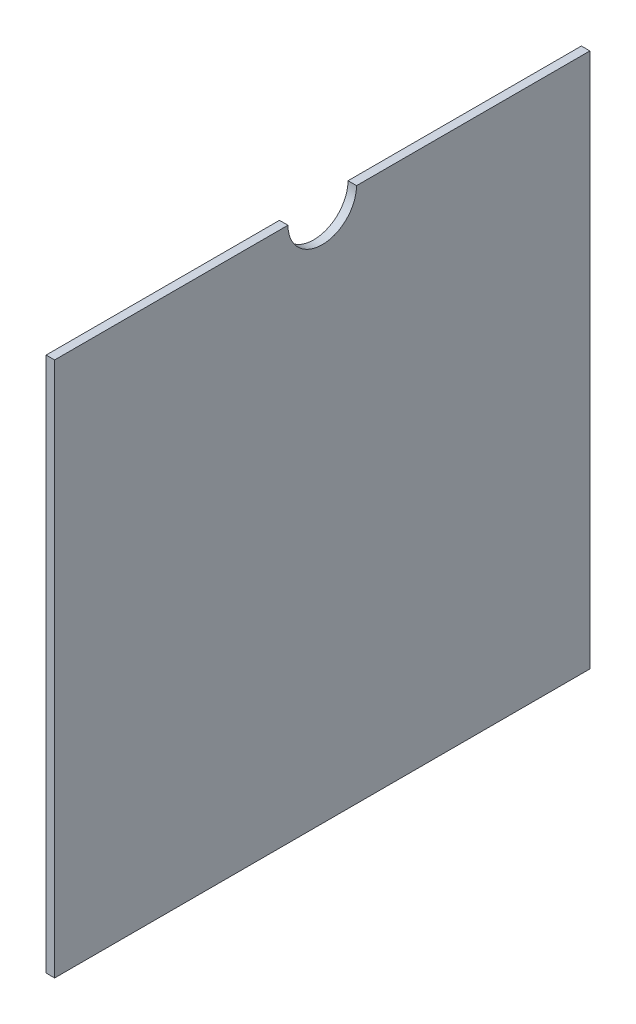
ISO-10303-21;
HEADER;
FILE_DESCRIPTION(('STEP AP214'),'2;1');
FILE_NAME('part.step','',(''),(''),'','','');
FILE_SCHEMA(('AUTOMOTIVE_DESIGN { 1 0 10303 214 1 1 1 1 }'));
ENDSEC;
DATA;
#1=APPLICATION_CONTEXT('core data for automotive mechanical design processes');
#2=APPLICATION_PROTOCOL_DEFINITION('international standard','automotive_design',2000,#1);
#3=PRODUCT_CONTEXT('',#1,'mechanical');
#4=PRODUCT('Part','Part','',(#3));
#5=PRODUCT_RELATED_PRODUCT_CATEGORY('part','',(#4));
#6=PRODUCT_DEFINITION_FORMATION('','',#4);
#7=PRODUCT_DEFINITION_CONTEXT('part definition',#1,'design');
#8=PRODUCT_DEFINITION('design','',#6,#7);
#9=PRODUCT_DEFINITION_SHAPE('','',#8);
#10=(LENGTH_UNIT() NAMED_UNIT(*) SI_UNIT(.MILLI.,.METRE.));
#11=(NAMED_UNIT(*) PLANE_ANGLE_UNIT() SI_UNIT($,.RADIAN.));
#12=(NAMED_UNIT(*) SI_UNIT($,.STERADIAN.) SOLID_ANGLE_UNIT());
#13=UNCERTAINTY_MEASURE_WITH_UNIT(LENGTH_MEASURE(1.E-05),#10,'distance_accuracy_value','');
#14=(GEOMETRIC_REPRESENTATION_CONTEXT(3) GLOBAL_UNCERTAINTY_ASSIGNED_CONTEXT((#13)) GLOBAL_UNIT_ASSIGNED_CONTEXT((#10,
#11,#12)) REPRESENTATION_CONTEXT('',''));
#15=CARTESIAN_POINT('',(0.,0.,0.));
#16=DIRECTION('',(0.,0.,1.));
#17=DIRECTION('',(1.,0.,0.));
#18=AXIS2_PLACEMENT_3D('',#15,#16,#17);
#19=CARTESIAN_POINT('',(0.,199.9996,-99.9998));
#20=DIRECTION('',(1.,0.,0.));
#21=DIRECTION('',(0.,0.,-1.));
#22=AXIS2_PLACEMENT_3D('',#19,#20,#21);
#23=PLANE('',#22);
#24=DIRECTION('',(0.,1.,0.));
#25=VECTOR('',#24,1.);
#26=CARTESIAN_POINT('',(0.,0.1016,-199.898));
#27=LINE('',#26,#25);
#28=CARTESIAN_POINT('',(0.,0.1016,-199.898));
#29=VERTEX_POINT('',#28);
#30=CARTESIAN_POINT('',(0.,199.898,-199.898));
#31=VERTEX_POINT('',#30);
#32=EDGE_CURVE('E63',#29,#31,#27,.T.);
#33=ORIENTED_EDGE('',*,*,#32,.F.);
#34=DIRECTION('',(0.,0.,-1.));
#35=VECTOR('',#34,1.);
#36=CARTESIAN_POINT('',(0.,0.1016,-0.1016));
#37=LINE('',#36,#35);
#38=CARTESIAN_POINT('',(0.,0.1016,-0.1016));
#39=VERTEX_POINT('',#38);
#40=EDGE_CURVE('E119',#39,#29,#37,.T.);
#41=ORIENTED_EDGE('',*,*,#40,.F.);
#42=DIRECTION('',(0.,-1.,0.));
#43=VECTOR('',#42,1.);
#44=CARTESIAN_POINT('',(0.,199.898,-0.1016));
#45=LINE('',#44,#43);
#46=CARTESIAN_POINT('',(0.,199.898,-0.1016));
#47=VERTEX_POINT('',#46);
#48=EDGE_CURVE('E115',#47,#39,#45,.T.);
#49=ORIENTED_EDGE('',*,*,#48,.F.);
#50=DIRECTION('',(0.,0.,1.));
#51=VECTOR('',#50,1.);
#52=CARTESIAN_POINT('',(0.,199.898,-87.1986031809522));
#53=LINE('',#52,#51);
#54=CARTESIAN_POINT('',(0.,199.898,-87.1986031809522));
#55=VERTEX_POINT('',#54);
#56=EDGE_CURVE('E96',#55,#47,#53,.T.);
#57=ORIENTED_EDGE('',*,*,#56,.F.);
#58=CARTESIAN_POINT('',(0.,199.9996,-99.9998));
#59=DIRECTION('',(-1.,0.,0.));
#60=DIRECTION('',(0.,0.,-1.));
#61=AXIS2_PLACEMENT_3D('',#58,#59,#60);
#62=CIRCLE('',#61,12.8016);
#63=CARTESIAN_POINT('',(0.,199.898,-112.800996819048));
#64=VERTEX_POINT('',#63);
#65=EDGE_CURVE('E105',#64,#55,#62,.T.);
#66=ORIENTED_EDGE('',*,*,#65,.F.);
#67=DIRECTION('',(0.,0.,1.));
#68=VECTOR('',#67,1.);
#69=CARTESIAN_POINT('',(0.,199.898,-199.898));
#70=LINE('',#69,#68);
#71=EDGE_CURVE('E111',#31,#64,#70,.T.);
#72=ORIENTED_EDGE('',*,*,#71,.F.);
#73=EDGE_LOOP('',(#33,#41,#49,#57,#66,#72));
#74=FACE_BOUND('',#73,.T.);
#75=ADVANCED_FACE('F38',(#74),#23,.F.);
#76=CARTESIAN_POINT('',(0.,0.1016,-199.898));
#77=DIRECTION('',(0.,0.,-1.));
#78=DIRECTION('',(-1.,0.,0.));
#79=AXIS2_PLACEMENT_3D('',#76,#77,#78);
#80=PLANE('',#79);
#81=DIRECTION('',(0.,1.,0.));
#82=VECTOR('',#81,1.);
#83=CARTESIAN_POINT('',(3.175,0.1016,-199.898));
#84=LINE('',#83,#82);
#85=CARTESIAN_POINT('',(3.175,0.1016,-199.898));
#86=VERTEX_POINT('',#85);
#87=CARTESIAN_POINT('',(3.175,199.898,-199.898));
#88=VERTEX_POINT('',#87);
#89=EDGE_CURVE('E126',#86,#88,#84,.T.);
#90=ORIENTED_EDGE('',*,*,#89,.F.);
#91=DIRECTION('',(1.,0.,0.));
#92=VECTOR('',#91,1.);
#93=CARTESIAN_POINT('',(0.,0.1016,-199.898));
#94=LINE('',#93,#92);
#95=EDGE_CURVE('E11',#29,#86,#94,.T.);
#96=ORIENTED_EDGE('',*,*,#95,.F.);
#97=ORIENTED_EDGE('',*,*,#32,.T.);
#98=DIRECTION('',(1.,0.,0.));
#99=VECTOR('',#98,1.);
#100=CARTESIAN_POINT('',(0.,199.898,-199.898));
#101=LINE('',#100,#99);
#102=EDGE_CURVE('E41',#31,#88,#101,.T.);
#103=ORIENTED_EDGE('',*,*,#102,.T.);
#104=EDGE_LOOP('',(#90,#96,#97,#103));
#105=FACE_BOUND('',#104,.T.);
#106=ADVANCED_FACE('F154',(#105),#80,.T.);
#107=CARTESIAN_POINT('',(0.,0.1016,-0.1016));
#108=DIRECTION('',(0.,-1.,0.));
#109=DIRECTION('',(0.,0.,-1.));
#110=AXIS2_PLACEMENT_3D('',#107,#108,#109);
#111=PLANE('',#110);
#112=DIRECTION('',(0.,0.,-1.));
#113=VECTOR('',#112,1.);
#114=CARTESIAN_POINT('',(3.175,0.1016,-0.1016));
#115=LINE('',#114,#113);
#116=CARTESIAN_POINT('',(3.175,0.1016,-0.1016));
#117=VERTEX_POINT('',#116);
#118=EDGE_CURVE('E142',#117,#86,#115,.T.);
#119=ORIENTED_EDGE('',*,*,#118,.F.);
#120=DIRECTION('',(1.,0.,0.));
#121=VECTOR('',#120,1.);
#122=CARTESIAN_POINT('',(0.,0.1016,-0.1016));
#123=LINE('',#122,#121);
#124=EDGE_CURVE('E47',#39,#117,#123,.T.);
#125=ORIENTED_EDGE('',*,*,#124,.F.);
#126=ORIENTED_EDGE('',*,*,#40,.T.);
#127=ORIENTED_EDGE('',*,*,#95,.T.);
#128=EDGE_LOOP('',(#119,#125,#126,#127));
#129=FACE_BOUND('',#128,.T.);
#130=ADVANCED_FACE('F161',(#129),#111,.T.);
#131=CARTESIAN_POINT('',(0.,199.898,-0.1016));
#132=DIRECTION('',(0.,0.,1.));
#133=DIRECTION('',(1.,0.,0.));
#134=AXIS2_PLACEMENT_3D('',#131,#132,#133);
#135=PLANE('',#134);
#136=DIRECTION('',(0.,-1.,0.));
#137=VECTOR('',#136,1.);
#138=CARTESIAN_POINT('',(3.175,199.898,-0.1016));
#139=LINE('',#138,#137);
#140=CARTESIAN_POINT('',(3.175,199.898,-0.1016));
#141=VERTEX_POINT('',#140);
#142=EDGE_CURVE('E138',#141,#117,#139,.T.);
#143=ORIENTED_EDGE('',*,*,#142,.F.);
#144=DIRECTION('',(1.,0.,0.));
#145=VECTOR('',#144,1.);
#146=CARTESIAN_POINT('',(0.,199.898,-0.1016));
#147=LINE('',#146,#145);
#148=EDGE_CURVE('E101',#47,#141,#147,.T.);
#149=ORIENTED_EDGE('',*,*,#148,.F.);
#150=ORIENTED_EDGE('',*,*,#48,.T.);
#151=ORIENTED_EDGE('',*,*,#124,.T.);
#152=EDGE_LOOP('',(#143,#149,#150,#151));
#153=FACE_BOUND('',#152,.T.);
#154=ADVANCED_FACE('F166',(#153),#135,.T.);
#155=CARTESIAN_POINT('',(0.,199.898,-87.1986031809522));
#156=DIRECTION('',(0.,1.,0.));
#157=DIRECTION('',(0.,0.,1.));
#158=AXIS2_PLACEMENT_3D('',#155,#156,#157);
#159=PLANE('',#158);
#160=DIRECTION('',(0.,0.,1.));
#161=VECTOR('',#160,1.);
#162=CARTESIAN_POINT('',(3.175,199.898,-87.1986031809522));
#163=LINE('',#162,#161);
#164=CARTESIAN_POINT('',(3.175,199.898,-87.1986031809522));
#165=VERTEX_POINT('',#164);
#166=EDGE_CURVE('E99',#165,#141,#163,.T.);
#167=ORIENTED_EDGE('',*,*,#166,.F.);
#168=DIRECTION('',(1.,0.,0.));
#169=VECTOR('',#168,1.);
#170=CARTESIAN_POINT('',(0.,199.898,-87.1986031809522));
#171=LINE('',#170,#169);
#172=EDGE_CURVE('E92',#55,#165,#171,.T.);
#173=ORIENTED_EDGE('',*,*,#172,.F.);
#174=ORIENTED_EDGE('',*,*,#56,.T.);
#175=ORIENTED_EDGE('',*,*,#148,.T.);
#176=EDGE_LOOP('',(#167,#173,#174,#175));
#177=FACE_BOUND('',#176,.T.);
#178=ADVANCED_FACE('F94',(#177),#159,.T.);
#179=CARTESIAN_POINT('',(0.,199.9996,-99.9998));
#180=DIRECTION('',(1.,0.,0.));
#181=DIRECTION('',(0.,0.,-1.));
#182=AXIS2_PLACEMENT_3D('',#179,#180,#181);
#183=CYLINDRICAL_SURFACE('',#182,12.8016);
#184=CARTESIAN_POINT('',(3.175,199.9996,-99.9998));
#185=DIRECTION('',(-1.,0.,0.));
#186=DIRECTION('',(0.,0.,-1.));
#187=AXIS2_PLACEMENT_3D('',#184,#185,#186);
#188=CIRCLE('',#187,12.8016);
#189=CARTESIAN_POINT('',(3.175,199.898,-112.800996819048));
#190=VERTEX_POINT('',#189);
#191=EDGE_CURVE('E55',#190,#165,#188,.T.);
#192=ORIENTED_EDGE('',*,*,#191,.F.);
#193=DIRECTION('',(1.,0.,0.));
#194=VECTOR('',#193,1.);
#195=CARTESIAN_POINT('',(0.,199.898,-112.800996819048));
#196=LINE('',#195,#194);
#197=EDGE_CURVE('E102',#64,#190,#196,.T.);
#198=ORIENTED_EDGE('',*,*,#197,.F.);
#199=ORIENTED_EDGE('',*,*,#65,.T.);
#200=ORIENTED_EDGE('',*,*,#172,.T.);
#201=EDGE_LOOP('',(#192,#198,#199,#200));
#202=FACE_BOUND('',#201,.T.);
#203=ADVANCED_FACE('F106',(#202),#183,.F.);
#204=CARTESIAN_POINT('',(0.,199.898,-199.898));
#205=DIRECTION('',(0.,1.,0.));
#206=DIRECTION('',(0.,0.,1.));
#207=AXIS2_PLACEMENT_3D('',#204,#205,#206);
#208=PLANE('',#207);
#209=DIRECTION('',(0.,0.,1.));
#210=VECTOR('',#209,1.);
#211=CARTESIAN_POINT('',(3.175,199.898,-199.898));
#212=LINE('',#211,#210);
#213=EDGE_CURVE('E130',#88,#190,#212,.T.);
#214=ORIENTED_EDGE('',*,*,#213,.F.);
#215=ORIENTED_EDGE('',*,*,#102,.F.);
#216=ORIENTED_EDGE('',*,*,#71,.T.);
#217=ORIENTED_EDGE('',*,*,#197,.T.);
#218=EDGE_LOOP('',(#214,#215,#216,#217));
#219=FACE_BOUND('',#218,.T.);
#220=ADVANCED_FACE('F155',(#219),#208,.T.);
#221=CARTESIAN_POINT('',(3.175,199.9996,-99.9998));
#222=DIRECTION('',(1.,0.,0.));
#223=DIRECTION('',(0.,0.,-1.));
#224=AXIS2_PLACEMENT_3D('',#221,#222,#223);
#225=PLANE('',#224);
#226=ORIENTED_EDGE('',*,*,#118,.T.);
#227=ORIENTED_EDGE('',*,*,#89,.T.);
#228=ORIENTED_EDGE('',*,*,#213,.T.);
#229=ORIENTED_EDGE('',*,*,#191,.T.);
#230=ORIENTED_EDGE('',*,*,#166,.T.);
#231=ORIENTED_EDGE('',*,*,#142,.T.);
#232=EDGE_LOOP('',(#226,#227,#228,#229,#230,#231));
#233=FACE_BOUND('',#232,.T.);
#234=ADVANCED_FACE('F157',(#233),#225,.T.);
#235=CLOSED_SHELL('',(#75,#106,#130,#154,#178,#203,#220,#234));
#236=MANIFOLD_SOLID_BREP('B2',#235);
#237=ADVANCED_BREP_SHAPE_REPRESENTATION('',(#18,#236),#14);
#238=SHAPE_DEFINITION_REPRESENTATION(#9,#237);
ENDSEC;
END-ISO-10303-21;
